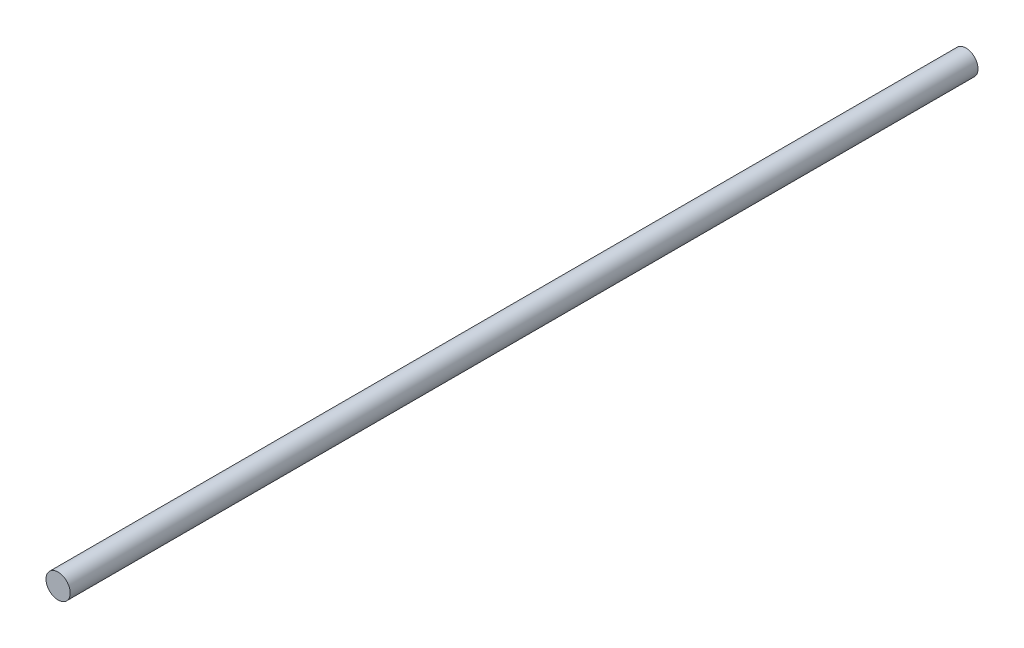
ISO-10303-21;
HEADER;
FILE_DESCRIPTION(('STEP AP214'),'2;1');
FILE_NAME('part.step','',(''),(''),'','','');
FILE_SCHEMA(('AUTOMOTIVE_DESIGN { 1 0 10303 214 1 1 1 1 }'));
ENDSEC;
DATA;
#1=APPLICATION_CONTEXT('core data for automotive mechanical design processes');
#2=APPLICATION_PROTOCOL_DEFINITION('international standard','automotive_design',2000,#1);
#3=PRODUCT_CONTEXT('',#1,'mechanical');
#4=PRODUCT('Part','Part','',(#3));
#5=PRODUCT_RELATED_PRODUCT_CATEGORY('part','',(#4));
#6=PRODUCT_DEFINITION_FORMATION('','',#4);
#7=PRODUCT_DEFINITION_CONTEXT('part definition',#1,'design');
#8=PRODUCT_DEFINITION('design','',#6,#7);
#9=PRODUCT_DEFINITION_SHAPE('','',#8);
#10=(LENGTH_UNIT() NAMED_UNIT(*) SI_UNIT(.MILLI.,.METRE.));
#11=(NAMED_UNIT(*) PLANE_ANGLE_UNIT() SI_UNIT($,.RADIAN.));
#12=(NAMED_UNIT(*) SI_UNIT($,.STERADIAN.) SOLID_ANGLE_UNIT());
#13=UNCERTAINTY_MEASURE_WITH_UNIT(LENGTH_MEASURE(1.E-05),#10,'distance_accuracy_value','');
#14=(GEOMETRIC_REPRESENTATION_CONTEXT(3) GLOBAL_UNCERTAINTY_ASSIGNED_CONTEXT((#13)) GLOBAL_UNIT_ASSIGNED_CONTEXT((#10,
#11,#12)) REPRESENTATION_CONTEXT('',''));
#15=CARTESIAN_POINT('',(0.,0.,0.));
#16=DIRECTION('',(0.,0.,1.));
#17=DIRECTION('',(1.,0.,0.));
#18=AXIS2_PLACEMENT_3D('',#15,#16,#17);
#19=CARTESIAN_POINT('',(0.,0.,150.));
#20=DIRECTION('',(0.,0.,-1.));
#21=DIRECTION('',(-1.,0.,0.));
#22=AXIS2_PLACEMENT_3D('',#19,#20,#21);
#23=CYLINDRICAL_SURFACE('',#22,2.);
#24=CARTESIAN_POINT('',(0.,0.,150.));
#25=DIRECTION('',(0.,0.,1.));
#26=DIRECTION('',(1.,0.,0.));
#27=AXIS2_PLACEMENT_3D('',#24,#25,#26);
#28=CIRCLE('',#27,2.);
#29=CARTESIAN_POINT('',(2.,0.,150.));
#30=VERTEX_POINT('',#29);
#31=EDGE_CURVE('E10',#30,#30,#28,.T.);
#32=ORIENTED_EDGE('',*,*,#31,.F.);
#33=EDGE_LOOP('',(#32));
#34=FACE_BOUND('',#33,.T.);
#35=CARTESIAN_POINT('',(0.,0.,0.));
#36=DIRECTION('',(0.,0.,1.));
#37=DIRECTION('',(1.,0.,0.));
#38=AXIS2_PLACEMENT_3D('',#35,#36,#37);
#39=CIRCLE('',#38,2.);
#40=CARTESIAN_POINT('',(2.,0.,0.));
#41=VERTEX_POINT('',#40);
#42=EDGE_CURVE('E34',#41,#41,#39,.T.);
#43=ORIENTED_EDGE('',*,*,#42,.T.);
#44=EDGE_LOOP('',(#43));
#45=FACE_BOUND('',#44,.T.);
#46=ADVANCED_FACE('F31',(#34,#45),#23,.T.);
#47=CARTESIAN_POINT('',(0.,0.,150.));
#48=DIRECTION('',(0.,0.,1.));
#49=DIRECTION('',(1.,0.,0.));
#50=AXIS2_PLACEMENT_3D('',#47,#48,#49);
#51=PLANE('',#50);
#52=ORIENTED_EDGE('',*,*,#31,.T.);
#53=EDGE_LOOP('',(#52));
#54=FACE_BOUND('',#53,.T.);
#55=ADVANCED_FACE('F46',(#54),#51,.T.);
#56=CARTESIAN_POINT('',(0.,0.,0.));
#57=DIRECTION('',(0.,0.,1.));
#58=DIRECTION('',(1.,0.,0.));
#59=AXIS2_PLACEMENT_3D('',#56,#57,#58);
#60=PLANE('',#59);
#61=ORIENTED_EDGE('',*,*,#42,.F.);
#62=EDGE_LOOP('',(#61));
#63=FACE_BOUND('',#62,.T.);
#64=ADVANCED_FACE('F44',(#63),#60,.F.);
#65=CLOSED_SHELL('',(#46,#55,#64));
#66=MANIFOLD_SOLID_BREP('B2',#65);
#67=ADVANCED_BREP_SHAPE_REPRESENTATION('',(#18,#66),#14);
#68=SHAPE_DEFINITION_REPRESENTATION(#9,#67);
ENDSEC;
END-ISO-10303-21;
